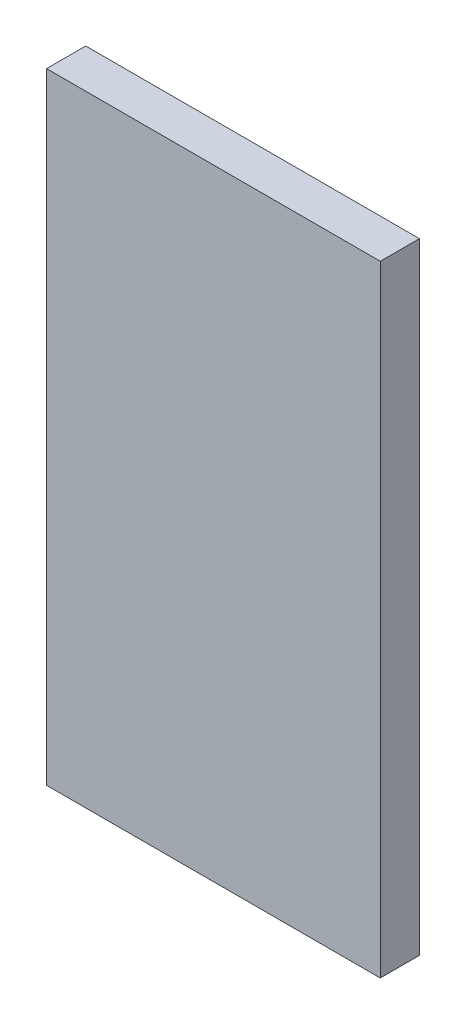
ISO-10303-21;
HEADER;
FILE_DESCRIPTION(('STEP AP214'),'2;1');
FILE_NAME('part.step','',(''),(''),'','','');
FILE_SCHEMA(('AUTOMOTIVE_DESIGN { 1 0 10303 214 1 1 1 1 }'));
ENDSEC;
DATA;
#1=APPLICATION_CONTEXT('core data for automotive mechanical design processes');
#2=APPLICATION_PROTOCOL_DEFINITION('international standard','automotive_design',2000,#1);
#3=PRODUCT_CONTEXT('',#1,'mechanical');
#4=PRODUCT('Part','Part','',(#3));
#5=PRODUCT_RELATED_PRODUCT_CATEGORY('part','',(#4));
#6=PRODUCT_DEFINITION_FORMATION('','',#4);
#7=PRODUCT_DEFINITION_CONTEXT('part definition',#1,'design');
#8=PRODUCT_DEFINITION('design','',#6,#7);
#9=PRODUCT_DEFINITION_SHAPE('','',#8);
#10=(LENGTH_UNIT() NAMED_UNIT(*) SI_UNIT(.MILLI.,.METRE.));
#11=(NAMED_UNIT(*) PLANE_ANGLE_UNIT() SI_UNIT($,.RADIAN.));
#12=(NAMED_UNIT(*) SI_UNIT($,.STERADIAN.) SOLID_ANGLE_UNIT());
#13=UNCERTAINTY_MEASURE_WITH_UNIT(LENGTH_MEASURE(1.E-05),#10,'distance_accuracy_value','');
#14=(GEOMETRIC_REPRESENTATION_CONTEXT(3) GLOBAL_UNCERTAINTY_ASSIGNED_CONTEXT((#13)) GLOBAL_UNIT_ASSIGNED_CONTEXT((#10,
#11,#12)) REPRESENTATION_CONTEXT('',''));
#15=CARTESIAN_POINT('',(0.,0.,0.));
#16=DIRECTION('',(0.,0.,1.));
#17=DIRECTION('',(1.,0.,0.));
#18=AXIS2_PLACEMENT_3D('',#15,#16,#17);
#19=CARTESIAN_POINT('',(-42.601535919799,-332.946938472014,-5.));
#20=DIRECTION('',(0.,-1.,0.));
#21=DIRECTION('',(0.,0.,-1.));
#22=AXIS2_PLACEMENT_3D('',#19,#20,#21);
#23=PLANE('',#22);
#24=DIRECTION('',(1.,0.,0.));
#25=VECTOR('',#24,1.);
#26=CARTESIAN_POINT('',(-42.601535919799,-332.946938472014,0.));
#27=LINE('',#26,#25);
#28=CARTESIAN_POINT('',(-42.601535919799,-332.946938472014,0.));
#29=VERTEX_POINT('',#28);
#30=CARTESIAN_POINT('',(0.,-332.946938472014,0.));
#31=VERTEX_POINT('',#30);
#32=EDGE_CURVE('E97',#29,#31,#27,.T.);
#33=ORIENTED_EDGE('',*,*,#32,.F.);
#34=DIRECTION('',(0.,0.,1.));
#35=VECTOR('',#34,1.);
#36=CARTESIAN_POINT('',(-42.601535919799,-332.946938472014,-5.));
#37=LINE('',#36,#35);
#38=CARTESIAN_POINT('',(-42.601535919799,-332.946938472014,-5.));
#39=VERTEX_POINT('',#38);
#40=EDGE_CURVE('E11',#39,#29,#37,.T.);
#41=ORIENTED_EDGE('',*,*,#40,.F.);
#42=DIRECTION('',(1.,0.,0.));
#43=VECTOR('',#42,1.);
#44=CARTESIAN_POINT('',(-42.601535919799,-332.946938472014,-5.));
#45=LINE('',#44,#43);
#46=CARTESIAN_POINT('',(0.,-332.946938472014,-5.));
#47=VERTEX_POINT('',#46);
#48=EDGE_CURVE('E91',#39,#47,#45,.T.);
#49=ORIENTED_EDGE('',*,*,#48,.T.);
#50=DIRECTION('',(0.,0.,1.));
#51=VECTOR('',#50,1.);
#52=CARTESIAN_POINT('',(0.,-332.946938472014,-5.));
#53=LINE('',#52,#51);
#54=EDGE_CURVE('E36',#47,#31,#53,.T.);
#55=ORIENTED_EDGE('',*,*,#54,.T.);
#56=EDGE_LOOP('',(#33,#41,#49,#55));
#57=FACE_BOUND('',#56,.T.);
#58=ADVANCED_FACE('F33',(#57),#23,.T.);
#59=CARTESIAN_POINT('',(-42.601535919799,-332.946938472014,-5.));
#60=DIRECTION('',(-1.,0.,0.));
#61=DIRECTION('',(0.,0.,1.));
#62=AXIS2_PLACEMENT_3D('',#59,#60,#61);
#63=PLANE('',#62);
#64=DIRECTION('',(0.,-1.,0.));
#65=VECTOR('',#64,1.);
#66=CARTESIAN_POINT('',(-42.601535919799,-332.946938472014,0.));
#67=LINE('',#66,#65);
#68=CARTESIAN_POINT('',(-42.601535919799,-253.697976972543,0.));
#69=VERTEX_POINT('',#68);
#70=EDGE_CURVE('E93',#69,#29,#67,.T.);
#71=ORIENTED_EDGE('',*,*,#70,.F.);
#72=DIRECTION('',(0.,0.,1.));
#73=VECTOR('',#72,1.);
#74=CARTESIAN_POINT('',(-42.601535919799,-253.697976972543,-5.));
#75=LINE('',#74,#73);
#76=CARTESIAN_POINT('',(-42.601535919799,-253.697976972543,-5.));
#77=VERTEX_POINT('',#76);
#78=EDGE_CURVE('E42',#77,#69,#75,.T.);
#79=ORIENTED_EDGE('',*,*,#78,.F.);
#80=DIRECTION('',(0.,-1.,0.));
#81=VECTOR('',#80,1.);
#82=CARTESIAN_POINT('',(-42.601535919799,-332.946938472014,-5.));
#83=LINE('',#82,#81);
#84=EDGE_CURVE('E88',#77,#39,#83,.T.);
#85=ORIENTED_EDGE('',*,*,#84,.T.);
#86=ORIENTED_EDGE('',*,*,#40,.T.);
#87=EDGE_LOOP('',(#71,#79,#85,#86));
#88=FACE_BOUND('',#87,.T.);
#89=ADVANCED_FACE('F107',(#88),#63,.T.);
#90=CARTESIAN_POINT('',(-42.601535919799,-253.697976972543,-5.));
#91=DIRECTION('',(0.,1.,0.));
#92=DIRECTION('',(0.,0.,1.));
#93=AXIS2_PLACEMENT_3D('',#90,#91,#92);
#94=PLANE('',#93);
#95=DIRECTION('',(-1.,0.,0.));
#96=VECTOR('',#95,1.);
#97=CARTESIAN_POINT('',(-42.601535919799,-253.697976972543,0.));
#98=LINE('',#97,#96);
#99=CARTESIAN_POINT('',(0.,-253.697976972543,0.));
#100=VERTEX_POINT('',#99);
#101=EDGE_CURVE('E83',#100,#69,#98,.T.);
#102=ORIENTED_EDGE('',*,*,#101,.F.);
#103=DIRECTION('',(0.,0.,1.));
#104=VECTOR('',#103,1.);
#105=CARTESIAN_POINT('',(0.,-253.697976972543,-5.));
#106=LINE('',#105,#104);
#107=CARTESIAN_POINT('',(0.,-253.697976972543,-5.));
#108=VERTEX_POINT('',#107);
#109=EDGE_CURVE('E78',#108,#100,#106,.T.);
#110=ORIENTED_EDGE('',*,*,#109,.F.);
#111=DIRECTION('',(-1.,0.,0.));
#112=VECTOR('',#111,1.);
#113=CARTESIAN_POINT('',(-42.601535919799,-253.697976972543,-5.));
#114=LINE('',#113,#112);
#115=EDGE_CURVE('E81',#108,#77,#114,.T.);
#116=ORIENTED_EDGE('',*,*,#115,.T.);
#117=ORIENTED_EDGE('',*,*,#78,.T.);
#118=EDGE_LOOP('',(#102,#110,#116,#117));
#119=FACE_BOUND('',#118,.T.);
#120=ADVANCED_FACE('F80',(#119),#94,.T.);
#121=CARTESIAN_POINT('',(0.,-332.946938472014,-5.));
#122=DIRECTION('',(1.,0.,0.));
#123=DIRECTION('',(0.,0.,-1.));
#124=AXIS2_PLACEMENT_3D('',#121,#122,#123);
#125=PLANE('',#124);
#126=DIRECTION('',(0.,1.,0.));
#127=VECTOR('',#126,1.);
#128=CARTESIAN_POINT('',(0.,-332.946938472014,0.));
#129=LINE('',#128,#127);
#130=EDGE_CURVE('E100',#31,#100,#129,.T.);
#131=ORIENTED_EDGE('',*,*,#130,.F.);
#132=ORIENTED_EDGE('',*,*,#54,.F.);
#133=DIRECTION('',(0.,1.,0.));
#134=VECTOR('',#133,1.);
#135=CARTESIAN_POINT('',(0.,-332.946938472014,-5.));
#136=LINE('',#135,#134);
#137=EDGE_CURVE('E87',#47,#108,#136,.T.);
#138=ORIENTED_EDGE('',*,*,#137,.T.);
#139=ORIENTED_EDGE('',*,*,#109,.T.);
#140=EDGE_LOOP('',(#131,#132,#138,#139));
#141=FACE_BOUND('',#140,.T.);
#142=ADVANCED_FACE('F90',(#141),#125,.T.);
#143=CARTESIAN_POINT('',(0.,0.,-5.));
#144=DIRECTION('',(0.,0.,1.));
#145=DIRECTION('',(1.,0.,0.));
#146=AXIS2_PLACEMENT_3D('',#143,#144,#145);
#147=PLANE('',#146);
#148=ORIENTED_EDGE('',*,*,#48,.F.);
#149=ORIENTED_EDGE('',*,*,#84,.F.);
#150=ORIENTED_EDGE('',*,*,#115,.F.);
#151=ORIENTED_EDGE('',*,*,#137,.F.);
#152=EDGE_LOOP('',(#148,#149,#150,#151));
#153=FACE_BOUND('',#152,.T.);
#154=ADVANCED_FACE('F86',(#153),#147,.F.);
#155=CARTESIAN_POINT('',(0.,0.,0.));
#156=DIRECTION('',(0.,0.,1.));
#157=DIRECTION('',(1.,0.,0.));
#158=AXIS2_PLACEMENT_3D('',#155,#156,#157);
#159=PLANE('',#158);
#160=ORIENTED_EDGE('',*,*,#32,.T.);
#161=ORIENTED_EDGE('',*,*,#130,.T.);
#162=ORIENTED_EDGE('',*,*,#101,.T.);
#163=ORIENTED_EDGE('',*,*,#70,.T.);
#164=EDGE_LOOP('',(#160,#161,#162,#163));
#165=FACE_BOUND('',#164,.T.);
#166=ADVANCED_FACE('F106',(#165),#159,.T.);
#167=CLOSED_SHELL('',(#58,#89,#120,#142,#154,#166));
#168=MANIFOLD_SOLID_BREP('B2',#167);
#169=ADVANCED_BREP_SHAPE_REPRESENTATION('',(#18,#168),#14);
#170=SHAPE_DEFINITION_REPRESENTATION(#9,#169);
ENDSEC;
END-ISO-10303-21;
